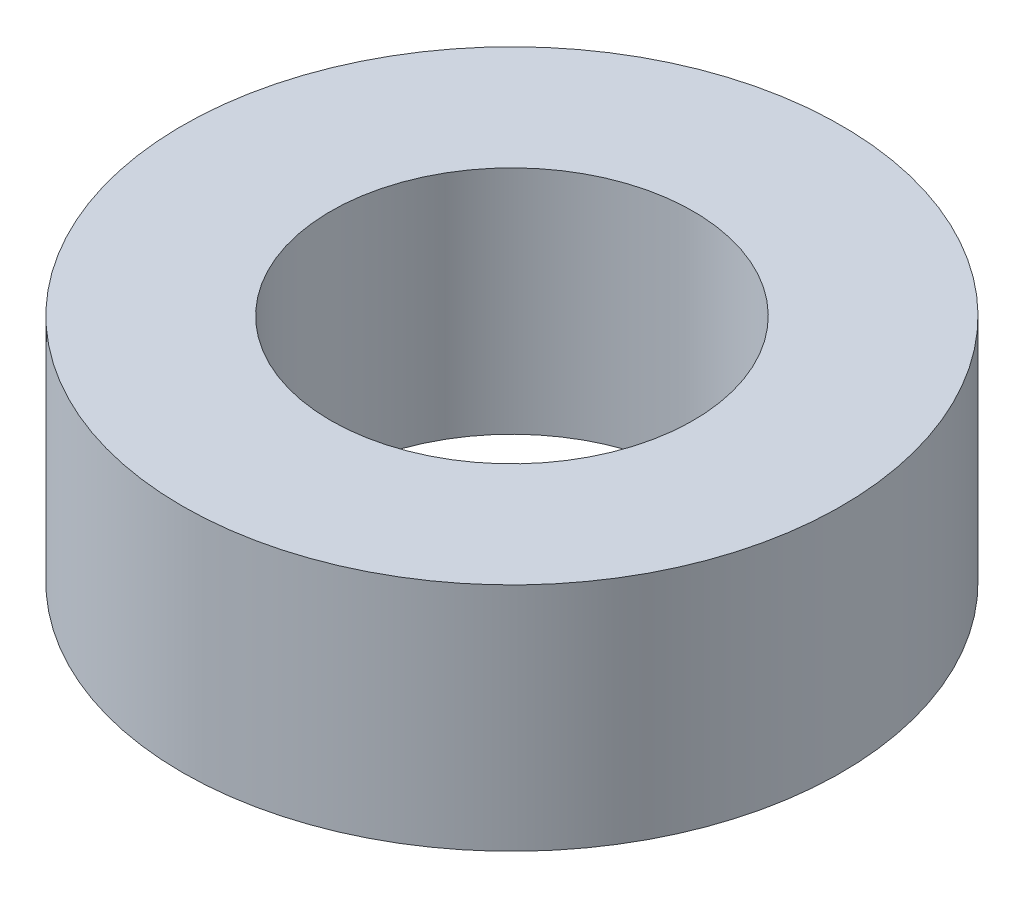
ISO-10303-21;
HEADER;
FILE_DESCRIPTION(('STEP AP214'),'2;1');
FILE_NAME('part.step','',(''),(''),'','','');
FILE_SCHEMA(('AUTOMOTIVE_DESIGN { 1 0 10303 214 1 1 1 1 }'));
ENDSEC;
DATA;
#1=APPLICATION_CONTEXT('core data for automotive mechanical design processes');
#2=APPLICATION_PROTOCOL_DEFINITION('international standard','automotive_design',2000,#1);
#3=PRODUCT_CONTEXT('',#1,'mechanical');
#4=PRODUCT('Part','Part','',(#3));
#5=PRODUCT_RELATED_PRODUCT_CATEGORY('part','',(#4));
#6=PRODUCT_DEFINITION_FORMATION('','',#4);
#7=PRODUCT_DEFINITION_CONTEXT('part definition',#1,'design');
#8=PRODUCT_DEFINITION('design','',#6,#7);
#9=PRODUCT_DEFINITION_SHAPE('','',#8);
#10=(LENGTH_UNIT() NAMED_UNIT(*) SI_UNIT(.MILLI.,.METRE.));
#11=(NAMED_UNIT(*) PLANE_ANGLE_UNIT() SI_UNIT($,.RADIAN.));
#12=(NAMED_UNIT(*) SI_UNIT($,.STERADIAN.) SOLID_ANGLE_UNIT());
#13=UNCERTAINTY_MEASURE_WITH_UNIT(LENGTH_MEASURE(1.E-05),#10,'distance_accuracy_value','');
#14=(GEOMETRIC_REPRESENTATION_CONTEXT(3) GLOBAL_UNCERTAINTY_ASSIGNED_CONTEXT((#13)) GLOBAL_UNIT_ASSIGNED_CONTEXT((#10,
#11,#12)) REPRESENTATION_CONTEXT('',''));
#15=CARTESIAN_POINT('',(0.,0.,0.));
#16=DIRECTION('',(0.,0.,1.));
#17=DIRECTION('',(1.,0.,0.));
#18=AXIS2_PLACEMENT_3D('',#15,#16,#17);
#19=CARTESIAN_POINT('',(0.,2.1,0.));
#20=DIRECTION('',(0.,1.,0.));
#21=DIRECTION('',(0.,0.,1.));
#22=AXIS2_PLACEMENT_3D('',#19,#20,#21);
#23=PLANE('',#22);
#24=CARTESIAN_POINT('',(0.,2.1,0.));
#25=DIRECTION('',(0.,1.,0.));
#26=DIRECTION('',(0.,0.,1.));
#27=AXIS2_PLACEMENT_3D('',#24,#25,#26);
#28=CIRCLE('',#27,3.);
#29=CARTESIAN_POINT('',(0.,2.1,3.));
#30=VERTEX_POINT('',#29);
#31=EDGE_CURVE('E10',#30,#30,#28,.T.);
#32=ORIENTED_EDGE('',*,*,#31,.T.);
#33=EDGE_LOOP('',(#32));
#34=FACE_BOUND('',#33,.T.);
#35=CARTESIAN_POINT('',(0.,2.1,0.));
#36=DIRECTION('',(0.,1.,0.));
#37=DIRECTION('',(0.,0.,1.));
#38=AXIS2_PLACEMENT_3D('',#35,#36,#37);
#39=CIRCLE('',#38,1.65);
#40=CARTESIAN_POINT('',(0.,2.1,1.65));
#41=VERTEX_POINT('',#40);
#42=EDGE_CURVE('E46',#41,#41,#39,.T.);
#43=ORIENTED_EDGE('',*,*,#42,.F.);
#44=EDGE_LOOP('',(#43));
#45=FACE_BOUND('',#44,.T.);
#46=ADVANCED_FACE('F35',(#34,#45),#23,.T.);
#47=CARTESIAN_POINT('',(0.,0.,0.));
#48=DIRECTION('',(0.,1.,0.));
#49=DIRECTION('',(0.,0.,1.));
#50=AXIS2_PLACEMENT_3D('',#47,#48,#49);
#51=PLANE('',#50);
#52=CARTESIAN_POINT('',(0.,0.,0.));
#53=DIRECTION('',(0.,1.,0.));
#54=DIRECTION('',(0.,0.,1.));
#55=AXIS2_PLACEMENT_3D('',#52,#53,#54);
#56=CIRCLE('',#55,3.);
#57=CARTESIAN_POINT('',(0.,0.,3.));
#58=VERTEX_POINT('',#57);
#59=EDGE_CURVE('E39',#58,#58,#56,.T.);
#60=ORIENTED_EDGE('',*,*,#59,.F.);
#61=EDGE_LOOP('',(#60));
#62=FACE_BOUND('',#61,.T.);
#63=CARTESIAN_POINT('',(0.,0.,0.));
#64=DIRECTION('',(0.,1.,0.));
#65=DIRECTION('',(0.,0.,1.));
#66=AXIS2_PLACEMENT_3D('',#63,#64,#65);
#67=CIRCLE('',#66,1.65);
#68=CARTESIAN_POINT('',(0.,0.,1.65));
#69=VERTEX_POINT('',#68);
#70=EDGE_CURVE('E48',#69,#69,#67,.T.);
#71=ORIENTED_EDGE('',*,*,#70,.T.);
#72=EDGE_LOOP('',(#71));
#73=FACE_BOUND('',#72,.T.);
#74=ADVANCED_FACE('F58',(#62,#73),#51,.F.);
#75=CARTESIAN_POINT('',(0.,2.1,0.));
#76=DIRECTION('',(0.,-1.,0.));
#77=DIRECTION('',(0.,0.,-1.));
#78=AXIS2_PLACEMENT_3D('',#75,#76,#77);
#79=CYLINDRICAL_SURFACE('',#78,3.);
#80=ORIENTED_EDGE('',*,*,#31,.F.);
#81=EDGE_LOOP('',(#80));
#82=FACE_BOUND('',#81,.T.);
#83=ORIENTED_EDGE('',*,*,#59,.T.);
#84=EDGE_LOOP('',(#83));
#85=FACE_BOUND('',#84,.T.);
#86=ADVANCED_FACE('F37',(#82,#85),#79,.T.);
#87=CARTESIAN_POINT('',(0.,2.1,0.));
#88=DIRECTION('',(0.,-1.,0.));
#89=DIRECTION('',(0.,0.,-1.));
#90=AXIS2_PLACEMENT_3D('',#87,#88,#89);
#91=CYLINDRICAL_SURFACE('',#90,1.65);
#92=ORIENTED_EDGE('',*,*,#42,.T.);
#93=EDGE_LOOP('',(#92));
#94=FACE_BOUND('',#93,.T.);
#95=ORIENTED_EDGE('',*,*,#70,.F.);
#96=EDGE_LOOP('',(#95));
#97=FACE_BOUND('',#96,.T.);
#98=ADVANCED_FACE('F54',(#94,#97),#91,.F.);
#99=CLOSED_SHELL('',(#46,#74,#86,#98));
#100=MANIFOLD_SOLID_BREP('B2',#99);
#101=ADVANCED_BREP_SHAPE_REPRESENTATION('',(#18,#100),#14);
#102=SHAPE_DEFINITION_REPRESENTATION(#9,#101);
ENDSEC;
END-ISO-10303-21;
